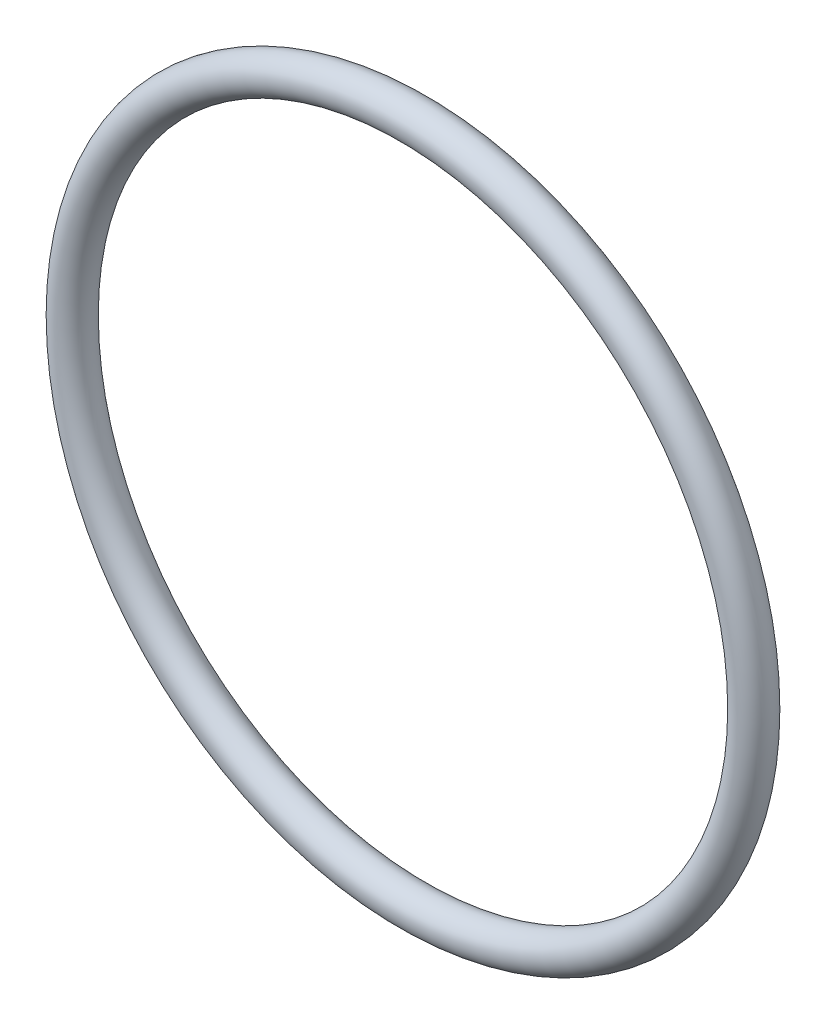
ISO-10303-21;
HEADER;
FILE_DESCRIPTION(('STEP AP214'),'2;1');
FILE_NAME('part.step','',(''),(''),'','','');
FILE_SCHEMA(('AUTOMOTIVE_DESIGN { 1 0 10303 214 1 1 1 1 }'));
ENDSEC;
DATA;
#1=APPLICATION_CONTEXT('core data for automotive mechanical design processes');
#2=APPLICATION_PROTOCOL_DEFINITION('international standard','automotive_design',2000,#1);
#3=PRODUCT_CONTEXT('',#1,'mechanical');
#4=PRODUCT('Part','Part','',(#3));
#5=PRODUCT_RELATED_PRODUCT_CATEGORY('part','',(#4));
#6=PRODUCT_DEFINITION_FORMATION('','',#4);
#7=PRODUCT_DEFINITION_CONTEXT('part definition',#1,'design');
#8=PRODUCT_DEFINITION('design','',#6,#7);
#9=PRODUCT_DEFINITION_SHAPE('','',#8);
#10=(LENGTH_UNIT() NAMED_UNIT(*) SI_UNIT(.MILLI.,.METRE.));
#11=(NAMED_UNIT(*) PLANE_ANGLE_UNIT() SI_UNIT($,.RADIAN.));
#12=(NAMED_UNIT(*) SI_UNIT($,.STERADIAN.) SOLID_ANGLE_UNIT());
#13=UNCERTAINTY_MEASURE_WITH_UNIT(LENGTH_MEASURE(1.E-05),#10,'distance_accuracy_value','');
#14=(GEOMETRIC_REPRESENTATION_CONTEXT(3) GLOBAL_UNCERTAINTY_ASSIGNED_CONTEXT((#13)) GLOBAL_UNIT_ASSIGNED_CONTEXT((#10,
#11,#12)) REPRESENTATION_CONTEXT('',''));
#15=CARTESIAN_POINT('',(0.,0.,0.));
#16=DIRECTION('',(0.,0.,1.));
#17=DIRECTION('',(1.,0.,0.));
#18=AXIS2_PLACEMENT_3D('',#15,#16,#17);
#19=CARTESIAN_POINT('',(0.,0.,0.));
#20=DIRECTION('',(0.,0.,1.));
#21=DIRECTION('',(1.,0.,0.));
#22=AXIS2_PLACEMENT_3D('',#19,#20,#21);
#23=TOROIDAL_SURFACE('',#22,24.1554,1.3081);
#24=CARTESIAN_POINT('',(25.4635,0.,0.));
#25=VERTEX_POINT('',#24);
#26=VERTEX_LOOP('',#25);
#27=FACE_BOUND('',#26,.T.);
#28=ADVANCED_FACE('F32',(#27),#23,.T.);
#29=CLOSED_SHELL('',(#28));
#30=MANIFOLD_SOLID_BREP('B2',#29);
#31=ADVANCED_BREP_SHAPE_REPRESENTATION('',(#18,#30),#14);
#32=SHAPE_DEFINITION_REPRESENTATION(#9,#31);
ENDSEC;
END-ISO-10303-21;
